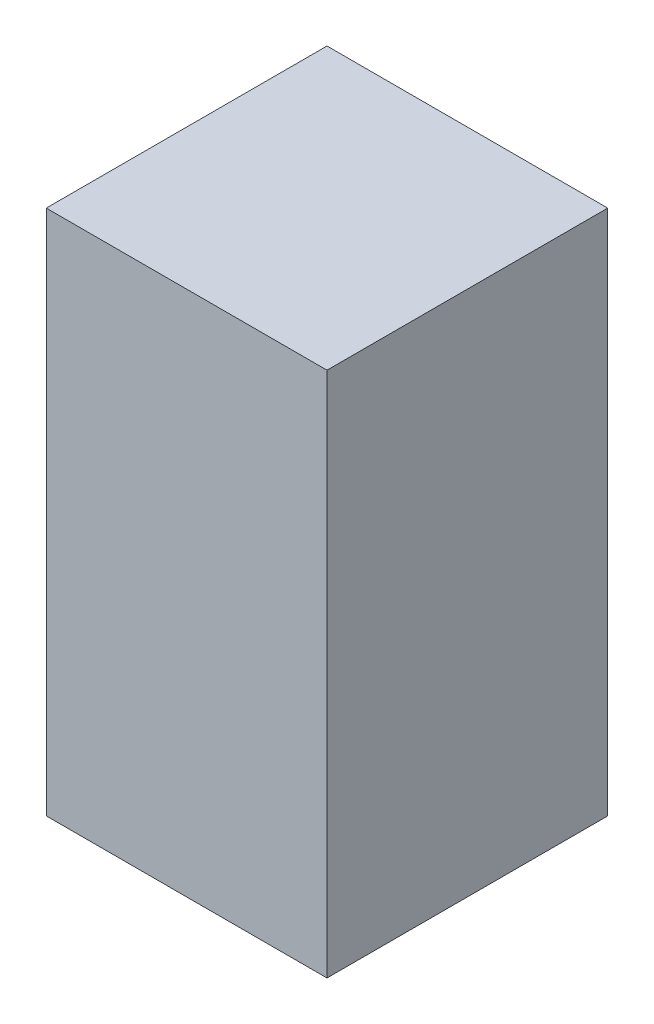
ISO-10303-21;
HEADER;
FILE_DESCRIPTION(('STEP AP214'),'2;1');
FILE_NAME('part.step','',(''),(''),'','','');
FILE_SCHEMA(('AUTOMOTIVE_DESIGN { 1 0 10303 214 1 1 1 1 }'));
ENDSEC;
DATA;
#1=APPLICATION_CONTEXT('core data for automotive mechanical design processes');
#2=APPLICATION_PROTOCOL_DEFINITION('international standard','automotive_design',2000,#1);
#3=PRODUCT_CONTEXT('',#1,'mechanical');
#4=PRODUCT('Part','Part','',(#3));
#5=PRODUCT_RELATED_PRODUCT_CATEGORY('part','',(#4));
#6=PRODUCT_DEFINITION_FORMATION('','',#4);
#7=PRODUCT_DEFINITION_CONTEXT('part definition',#1,'design');
#8=PRODUCT_DEFINITION('design','',#6,#7);
#9=PRODUCT_DEFINITION_SHAPE('','',#8);
#10=(LENGTH_UNIT() NAMED_UNIT(*) SI_UNIT(.MILLI.,.METRE.));
#11=(NAMED_UNIT(*) PLANE_ANGLE_UNIT() SI_UNIT($,.RADIAN.));
#12=(NAMED_UNIT(*) SI_UNIT($,.STERADIAN.) SOLID_ANGLE_UNIT());
#13=UNCERTAINTY_MEASURE_WITH_UNIT(LENGTH_MEASURE(1.E-05),#10,'distance_accuracy_value','');
#14=(GEOMETRIC_REPRESENTATION_CONTEXT(3) GLOBAL_UNCERTAINTY_ASSIGNED_CONTEXT((#13)) GLOBAL_UNIT_ASSIGNED_CONTEXT((#10,
#11,#12)) REPRESENTATION_CONTEXT('',''));
#15=CARTESIAN_POINT('',(0.,0.,0.));
#16=DIRECTION('',(0.,0.,1.));
#17=DIRECTION('',(1.,0.,0.));
#18=AXIS2_PLACEMENT_3D('',#15,#16,#17);
#19=CARTESIAN_POINT('',(-0.4,0.75,0.8));
#20=DIRECTION('',(1.,0.,0.));
#21=DIRECTION('',(0.,0.,-1.));
#22=AXIS2_PLACEMENT_3D('',#19,#20,#21);
#23=PLANE('',#22);
#24=DIRECTION('',(0.,-1.,0.));
#25=VECTOR('',#24,1.);
#26=CARTESIAN_POINT('',(-0.4,0.75,0.));
#27=LINE('',#26,#25);
#28=CARTESIAN_POINT('',(-0.4,0.75,0.));
#29=VERTEX_POINT('',#28);
#30=CARTESIAN_POINT('',(-0.4,-0.75,0.));
#31=VERTEX_POINT('',#30);
#32=EDGE_CURVE('E96',#29,#31,#27,.T.);
#33=ORIENTED_EDGE('',*,*,#32,.T.);
#34=DIRECTION('',(0.,0.,-1.));
#35=VECTOR('',#34,1.);
#36=CARTESIAN_POINT('',(-0.4,-0.75,0.8));
#37=LINE('',#36,#35);
#38=CARTESIAN_POINT('',(-0.4,-0.75,0.8));
#39=VERTEX_POINT('',#38);
#40=EDGE_CURVE('E11',#39,#31,#37,.T.);
#41=ORIENTED_EDGE('',*,*,#40,.F.);
#42=DIRECTION('',(0.,-1.,0.));
#43=VECTOR('',#42,1.);
#44=CARTESIAN_POINT('',(-0.4,0.75,0.8));
#45=LINE('',#44,#43);
#46=CARTESIAN_POINT('',(-0.4,0.75,0.8));
#47=VERTEX_POINT('',#46);
#48=EDGE_CURVE('E84',#47,#39,#45,.T.);
#49=ORIENTED_EDGE('',*,*,#48,.F.);
#50=DIRECTION('',(0.,0.,-1.));
#51=VECTOR('',#50,1.);
#52=CARTESIAN_POINT('',(-0.4,0.75,0.8));
#53=LINE('',#52,#51);
#54=EDGE_CURVE('E92',#47,#29,#53,.T.);
#55=ORIENTED_EDGE('',*,*,#54,.T.);
#56=EDGE_LOOP('',(#33,#41,#49,#55));
#57=FACE_BOUND('',#56,.T.);
#58=ADVANCED_FACE('F33',(#57),#23,.F.);
#59=CARTESIAN_POINT('',(-0.4,-0.75,0.8));
#60=DIRECTION('',(0.,1.,0.));
#61=DIRECTION('',(-1.,0.,0.));
#62=AXIS2_PLACEMENT_3D('',#59,#60,#61);
#63=PLANE('',#62);
#64=DIRECTION('',(1.,0.,0.));
#65=VECTOR('',#64,1.);
#66=CARTESIAN_POINT('',(-0.4,-0.75,0.));
#67=LINE('',#66,#65);
#68=CARTESIAN_POINT('',(0.4,-0.75,0.));
#69=VERTEX_POINT('',#68);
#70=EDGE_CURVE('E88',#31,#69,#67,.T.);
#71=ORIENTED_EDGE('',*,*,#70,.T.);
#72=DIRECTION('',(0.,0.,-1.));
#73=VECTOR('',#72,1.);
#74=CARTESIAN_POINT('',(0.4,-0.75,0.8));
#75=LINE('',#74,#73);
#76=CARTESIAN_POINT('',(0.4,-0.75,0.8));
#77=VERTEX_POINT('',#76);
#78=EDGE_CURVE('E41',#77,#69,#75,.T.);
#79=ORIENTED_EDGE('',*,*,#78,.F.);
#80=DIRECTION('',(1.,0.,0.));
#81=VECTOR('',#80,1.);
#82=CARTESIAN_POINT('',(-0.4,-0.75,0.8));
#83=LINE('',#82,#81);
#84=EDGE_CURVE('E79',#39,#77,#83,.T.);
#85=ORIENTED_EDGE('',*,*,#84,.F.);
#86=ORIENTED_EDGE('',*,*,#40,.T.);
#87=EDGE_LOOP('',(#71,#79,#85,#86));
#88=FACE_BOUND('',#87,.T.);
#89=ADVANCED_FACE('F87',(#88),#63,.F.);
#90=CARTESIAN_POINT('',(0.4,0.75,0.8));
#91=DIRECTION('',(-1.,0.,0.));
#92=DIRECTION('',(0.,-1.,0.));
#93=AXIS2_PLACEMENT_3D('',#90,#91,#92);
#94=PLANE('',#93);
#95=DIRECTION('',(0.,1.,0.));
#96=VECTOR('',#95,1.);
#97=CARTESIAN_POINT('',(0.4,0.75,0.));
#98=LINE('',#97,#96);
#99=CARTESIAN_POINT('',(0.4,0.75,0.));
#100=VERTEX_POINT('',#99);
#101=EDGE_CURVE('E66',#69,#100,#98,.T.);
#102=ORIENTED_EDGE('',*,*,#101,.T.);
#103=DIRECTION('',(0.,0.,-1.));
#104=VECTOR('',#103,1.);
#105=CARTESIAN_POINT('',(0.4,0.75,0.8));
#106=LINE('',#105,#104);
#107=CARTESIAN_POINT('',(0.4,0.75,0.8));
#108=VERTEX_POINT('',#107);
#109=EDGE_CURVE('E89',#108,#100,#106,.T.);
#110=ORIENTED_EDGE('',*,*,#109,.F.);
#111=DIRECTION('',(0.,1.,0.));
#112=VECTOR('',#111,1.);
#113=CARTESIAN_POINT('',(0.4,0.75,0.8));
#114=LINE('',#113,#112);
#115=EDGE_CURVE('E82',#77,#108,#114,.T.);
#116=ORIENTED_EDGE('',*,*,#115,.F.);
#117=ORIENTED_EDGE('',*,*,#78,.T.);
#118=EDGE_LOOP('',(#102,#110,#116,#117));
#119=FACE_BOUND('',#118,.T.);
#120=ADVANCED_FACE('F90',(#119),#94,.F.);
#121=CARTESIAN_POINT('',(-0.4,0.75,0.8));
#122=DIRECTION('',(0.,-1.,0.));
#123=DIRECTION('',(1.,0.,0.));
#124=AXIS2_PLACEMENT_3D('',#121,#122,#123);
#125=PLANE('',#124);
#126=DIRECTION('',(-1.,0.,0.));
#127=VECTOR('',#126,1.);
#128=CARTESIAN_POINT('',(-0.4,0.75,0.));
#129=LINE('',#128,#127);
#130=EDGE_CURVE('E72',#100,#29,#129,.T.);
#131=ORIENTED_EDGE('',*,*,#130,.T.);
#132=ORIENTED_EDGE('',*,*,#54,.F.);
#133=DIRECTION('',(-1.,0.,0.));
#134=VECTOR('',#133,1.);
#135=CARTESIAN_POINT('',(-0.4,0.75,0.8));
#136=LINE('',#135,#134);
#137=EDGE_CURVE('E49',#108,#47,#136,.T.);
#138=ORIENTED_EDGE('',*,*,#137,.F.);
#139=ORIENTED_EDGE('',*,*,#109,.T.);
#140=EDGE_LOOP('',(#131,#132,#138,#139));
#141=FACE_BOUND('',#140,.T.);
#142=ADVANCED_FACE('F103',(#141),#125,.F.);
#143=CARTESIAN_POINT('',(0.,0.,0.8));
#144=DIRECTION('',(0.,0.,1.));
#145=DIRECTION('',(1.,0.,0.));
#146=AXIS2_PLACEMENT_3D('',#143,#144,#145);
#147=PLANE('',#146);
#148=ORIENTED_EDGE('',*,*,#48,.T.);
#149=ORIENTED_EDGE('',*,*,#84,.T.);
#150=ORIENTED_EDGE('',*,*,#115,.T.);
#151=ORIENTED_EDGE('',*,*,#137,.T.);
#152=EDGE_LOOP('',(#148,#149,#150,#151));
#153=FACE_BOUND('',#152,.T.);
#154=ADVANCED_FACE('F80',(#153),#147,.T.);
#155=CARTESIAN_POINT('',(0.,0.,0.));
#156=DIRECTION('',(0.,0.,1.));
#157=DIRECTION('',(1.,0.,0.));
#158=AXIS2_PLACEMENT_3D('',#155,#156,#157);
#159=PLANE('',#158);
#160=ORIENTED_EDGE('',*,*,#32,.F.);
#161=ORIENTED_EDGE('',*,*,#130,.F.);
#162=ORIENTED_EDGE('',*,*,#101,.F.);
#163=ORIENTED_EDGE('',*,*,#70,.F.);
#164=EDGE_LOOP('',(#160,#161,#162,#163));
#165=FACE_BOUND('',#164,.T.);
#166=ADVANCED_FACE('F106',(#165),#159,.F.);
#167=CLOSED_SHELL('',(#58,#89,#120,#142,#154,#166));
#168=MANIFOLD_SOLID_BREP('B2',#167);
#169=ADVANCED_BREP_SHAPE_REPRESENTATION('',(#18,#168),#14);
#170=SHAPE_DEFINITION_REPRESENTATION(#9,#169);
ENDSEC;
END-ISO-10303-21;
